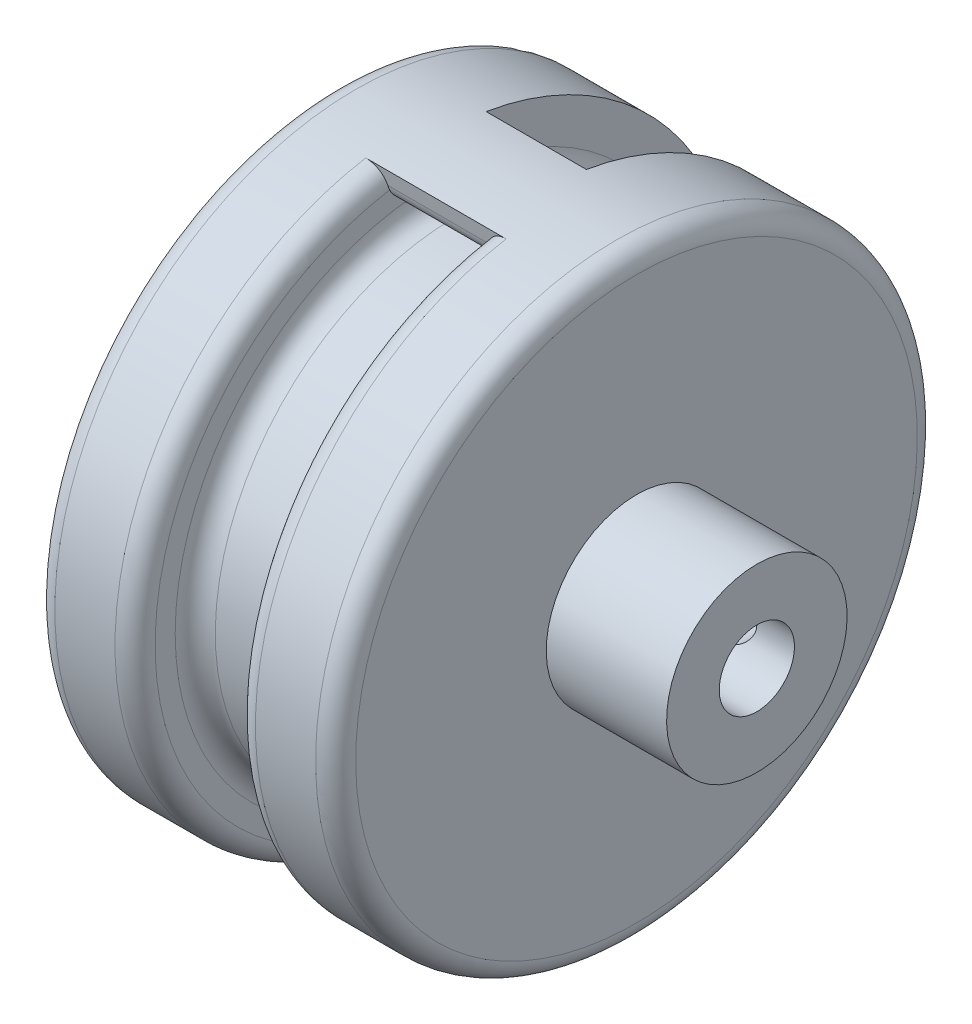
ISO-10303-21;
HEADER;
FILE_DESCRIPTION(('STEP AP214'),'2;1');
FILE_NAME('part.step','',(''),(''),'','','');
FILE_SCHEMA(('AUTOMOTIVE_DESIGN { 1 0 10303 214 1 1 1 1 }'));
ENDSEC;
DATA;
#1=APPLICATION_CONTEXT('core data for automotive mechanical design processes');
#2=APPLICATION_PROTOCOL_DEFINITION('international standard','automotive_design',2000,#1);
#3=PRODUCT_CONTEXT('',#1,'mechanical');
#4=PRODUCT('Part','Part','',(#3));
#5=PRODUCT_RELATED_PRODUCT_CATEGORY('part','',(#4));
#6=PRODUCT_DEFINITION_FORMATION('','',#4);
#7=PRODUCT_DEFINITION_CONTEXT('part definition',#1,'design');
#8=PRODUCT_DEFINITION('design','',#6,#7);
#9=PRODUCT_DEFINITION_SHAPE('','',#8);
#10=(LENGTH_UNIT() NAMED_UNIT(*) SI_UNIT(.MILLI.,.METRE.));
#11=(NAMED_UNIT(*) PLANE_ANGLE_UNIT() SI_UNIT($,.RADIAN.));
#12=(NAMED_UNIT(*) SI_UNIT($,.STERADIAN.) SOLID_ANGLE_UNIT());
#13=UNCERTAINTY_MEASURE_WITH_UNIT(LENGTH_MEASURE(1.E-05),#10,'distance_accuracy_value','');
#14=(GEOMETRIC_REPRESENTATION_CONTEXT(3) GLOBAL_UNCERTAINTY_ASSIGNED_CONTEXT((#13)) GLOBAL_UNIT_ASSIGNED_CONTEXT((#10,
#11,#12)) REPRESENTATION_CONTEXT('',''));
#15=CARTESIAN_POINT('',(0.,0.,0.));
#16=DIRECTION('',(0.,0.,1.));
#17=DIRECTION('',(1.,0.,0.));
#18=AXIS2_PLACEMENT_3D('',#15,#16,#17);
#19=CARTESIAN_POINT('',(-5.,30.,0.));
#20=DIRECTION('',(1.,0.,0.));
#21=DIRECTION('',(0.,1.,0.));
#22=AXIS2_PLACEMENT_3D('',#19,#20,#21);
#23=PLANE('',#22);
#24=CARTESIAN_POINT('',(-5.,0.,0.));
#25=DIRECTION('',(1.,0.,0.));
#26=DIRECTION('',(0.,1.,0.));
#27=AXIS2_PLACEMENT_3D('',#24,#25,#26);
#28=CIRCLE('',#27,26.);
#29=CARTESIAN_POINT('',(-5.,26.,0.));
#30=VERTEX_POINT('',#29);
#31=EDGE_CURVE('E639',#30,#30,#28,.F.);
#32=ORIENTED_EDGE('',*,*,#31,.T.);
#33=EDGE_LOOP('',(#32));
#34=FACE_BOUND('',#33,.T.);
#35=CARTESIAN_POINT('',(-5.,-3.50000000000014,0.));
#36=DIRECTION('',(1.,0.,0.));
#37=DIRECTION('',(0.,1.,0.));
#38=AXIS2_PLACEMENT_3D('',#35,#36,#37);
#39=CIRCLE('',#38,30.);
#40=CARTESIAN_POINT('',(-5.,26.3874965221958,2.59567941697875));
#41=VERTEX_POINT('',#40);
#42=CARTESIAN_POINT('',(-5.,26.3874965221958,-2.59567941697875));
#43=VERTEX_POINT('',#42);
#44=EDGE_CURVE('E200',#41,#43,#39,.F.);
#45=ORIENTED_EDGE('',*,*,#44,.F.);
#46=CARTESIAN_POINT('',(-5.,28.3799962903422,2.768724711444));
#47=DIRECTION('',(1.,0.,0.));
#48=DIRECTION('',(0.,1.,0.));
#49=AXIS2_PLACEMENT_3D('',#46,#47,#48);
#50=CIRCLE('',#49,2.);
#51=CARTESIAN_POINT('',(-5.,27.6166670042081,4.61732645355344));
#52=VERTEX_POINT('',#51);
#53=EDGE_CURVE('E54',#41,#52,#50,.F.);
#54=ORIENTED_EDGE('',*,*,#53,.T.);
#55=CARTESIAN_POINT('',(-5.,0.,0.));
#56=DIRECTION('',(1.,0.,0.));
#57=DIRECTION('',(0.,1.,0.));
#58=AXIS2_PLACEMENT_3D('',#55,#56,#57);
#59=CIRCLE('',#58,28.);
#60=CARTESIAN_POINT('',(-5.,-27.6166670042081,4.61732645355344));
#61=VERTEX_POINT('',#60);
#62=EDGE_CURVE('E60',#52,#61,#59,.T.);
#63=ORIENTED_EDGE('',*,*,#62,.T.);
#64=CARTESIAN_POINT('',(-5.,-28.3799962903422,2.768724711444));
#65=DIRECTION('',(1.,0.,0.));
#66=DIRECTION('',(0.,1.,0.));
#67=AXIS2_PLACEMENT_3D('',#64,#65,#66);
#68=CIRCLE('',#67,2.);
#69=CARTESIAN_POINT('',(-5.,-26.3874965221958,2.59567941697875));
#70=VERTEX_POINT('',#69);
#71=EDGE_CURVE('E347',#61,#70,#68,.F.);
#72=ORIENTED_EDGE('',*,*,#71,.T.);
#73=CARTESIAN_POINT('',(-5.,3.50000000000014,0.));
#74=DIRECTION('',(1.,0.,0.));
#75=DIRECTION('',(0.,1.,0.));
#76=AXIS2_PLACEMENT_3D('',#73,#74,#75);
#77=CIRCLE('',#76,30.);
#78=CARTESIAN_POINT('',(-5.,-26.3874965221958,-2.59567941697875));
#79=VERTEX_POINT('',#78);
#80=EDGE_CURVE('E385',#70,#79,#77,.T.);
#81=ORIENTED_EDGE('',*,*,#80,.T.);
#82=CARTESIAN_POINT('',(-5.,-28.3799962903422,-2.768724711444));
#83=DIRECTION('',(1.,0.,0.));
#84=DIRECTION('',(0.,1.,0.));
#85=AXIS2_PLACEMENT_3D('',#82,#83,#84);
#86=CIRCLE('',#85,2.);
#87=CARTESIAN_POINT('',(-5.,-28.0466629570088,-4.74075130581054));
#88=VERTEX_POINT('',#87);
#89=EDGE_CURVE('E337',#79,#88,#86,.F.);
#90=ORIENTED_EDGE('',*,*,#89,.T.);
#91=DIRECTION('',(0.,-0.986013297183269,-0.166666666666667));
#92=VECTOR('',#91,1.);
#93=CARTESIAN_POINT('',(-5.,29.1666666666667,4.93006648591635));
#94=LINE('',#93,#92);
#95=CARTESIAN_POINT('',(-5.,-29.5803989154981,-5.));
#96=VERTEX_POINT('',#95);
#97=EDGE_CURVE('E157',#88,#96,#94,.T.);
#98=ORIENTED_EDGE('',*,*,#97,.T.);
#99=CARTESIAN_POINT('',(-5.,0.,0.));
#100=DIRECTION('',(1.,0.,0.));
#101=DIRECTION('',(0.,1.,0.));
#102=AXIS2_PLACEMENT_3D('',#99,#100,#101);
#103=CIRCLE('',#102,30.);
#104=CARTESIAN_POINT('',(-5.,29.5803989154981,-5.));
#105=VERTEX_POINT('',#104);
#106=EDGE_CURVE('E166',#96,#105,#103,.T.);
#107=ORIENTED_EDGE('',*,*,#106,.T.);
#108=DIRECTION('',(0.,0.986013297183269,-0.166666666666667));
#109=VECTOR('',#108,1.);
#110=CARTESIAN_POINT('',(-5.,29.1666666666667,-4.93006648591635));
#111=LINE('',#110,#109);
#112=CARTESIAN_POINT('',(-5.,28.0466629570088,-4.74075130581054));
#113=VERTEX_POINT('',#112);
#114=EDGE_CURVE('E401',#113,#105,#111,.T.);
#115=ORIENTED_EDGE('',*,*,#114,.F.);
#116=CARTESIAN_POINT('',(-5.,28.3799962903422,-2.768724711444));
#117=DIRECTION('',(1.,0.,0.));
#118=DIRECTION('',(0.,1.,0.));
#119=AXIS2_PLACEMENT_3D('',#116,#117,#118);
#120=CIRCLE('',#119,2.);
#121=EDGE_CURVE('E278',#113,#43,#120,.F.);
#122=ORIENTED_EDGE('',*,*,#121,.T.);
#123=EDGE_LOOP('',(#45,#54,#63,#72,#81,#90,#98,#107,#115,#122));
#124=FACE_BOUND('',#123,.T.);
#125=ADVANCED_FACE('F39',(#34,#124),#23,.T.);
#126=CARTESIAN_POINT('',(5.,24.,0.));
#127=DIRECTION('',(-1.,0.,0.));
#128=DIRECTION('',(0.,-1.,0.));
#129=AXIS2_PLACEMENT_3D('',#126,#127,#128);
#130=PLANE('',#129);
#131=CARTESIAN_POINT('',(5.,0.,0.));
#132=DIRECTION('',(-1.,0.,0.));
#133=DIRECTION('',(0.,-1.,0.));
#134=AXIS2_PLACEMENT_3D('',#131,#132,#133);
#135=CIRCLE('',#134,26.);
#136=CARTESIAN_POINT('',(5.,-26.,0.));
#137=VERTEX_POINT('',#136);
#138=EDGE_CURVE('E625',#137,#137,#135,.F.);
#139=ORIENTED_EDGE('',*,*,#138,.T.);
#140=EDGE_LOOP('',(#139));
#141=FACE_BOUND('',#140,.T.);
#142=CARTESIAN_POINT('',(5.,3.50000000000014,0.));
#143=DIRECTION('',(-1.,0.,0.));
#144=DIRECTION('',(0.,-1.,0.));
#145=AXIS2_PLACEMENT_3D('',#142,#143,#144);
#146=CIRCLE('',#145,30.);
#147=CARTESIAN_POINT('',(5.,-26.3874965221958,-2.59567941697875));
#148=VERTEX_POINT('',#147);
#149=CARTESIAN_POINT('',(5.,-26.3874965221958,2.59567941697875));
#150=VERTEX_POINT('',#149);
#151=EDGE_CURVE('E387',#148,#150,#146,.T.);
#152=ORIENTED_EDGE('',*,*,#151,.T.);
#153=CARTESIAN_POINT('',(5.,-28.3799962903422,2.768724711444));
#154=DIRECTION('',(-1.,0.,0.));
#155=DIRECTION('',(0.,-1.,0.));
#156=AXIS2_PLACEMENT_3D('',#153,#154,#155);
#157=CIRCLE('',#156,2.);
#158=CARTESIAN_POINT('',(5.,-27.6166670042081,4.61732645355344));
#159=VERTEX_POINT('',#158);
#160=EDGE_CURVE('E339',#150,#159,#157,.F.);
#161=ORIENTED_EDGE('',*,*,#160,.T.);
#162=CARTESIAN_POINT('',(5.,0.,0.));
#163=DIRECTION('',(-1.,0.,0.));
#164=DIRECTION('',(0.,-1.,0.));
#165=AXIS2_PLACEMENT_3D('',#162,#163,#164);
#166=CIRCLE('',#165,28.);
#167=CARTESIAN_POINT('',(5.,27.6166670042081,4.61732645355344));
#168=VERTEX_POINT('',#167);
#169=EDGE_CURVE('E68',#159,#168,#166,.T.);
#170=ORIENTED_EDGE('',*,*,#169,.T.);
#171=CARTESIAN_POINT('',(5.,28.3799962903422,2.768724711444));
#172=DIRECTION('',(-1.,0.,0.));
#173=DIRECTION('',(0.,-1.,0.));
#174=AXIS2_PLACEMENT_3D('',#171,#172,#173);
#175=CIRCLE('',#174,2.);
#176=CARTESIAN_POINT('',(5.,26.3874965221958,2.59567941697875));
#177=VERTEX_POINT('',#176);
#178=EDGE_CURVE('E277',#168,#177,#175,.F.);
#179=ORIENTED_EDGE('',*,*,#178,.T.);
#180=CARTESIAN_POINT('',(5.,-3.50000000000014,0.));
#181=DIRECTION('',(-1.,0.,0.));
#182=DIRECTION('',(0.,-1.,0.));
#183=AXIS2_PLACEMENT_3D('',#180,#181,#182);
#184=CIRCLE('',#183,30.);
#185=CARTESIAN_POINT('',(5.,26.3874965221958,-2.59567941697875));
#186=VERTEX_POINT('',#185);
#187=EDGE_CURVE('E403',#186,#177,#184,.F.);
#188=ORIENTED_EDGE('',*,*,#187,.F.);
#189=CARTESIAN_POINT('',(5.,28.3799962903422,-2.768724711444));
#190=DIRECTION('',(-1.,0.,0.));
#191=DIRECTION('',(0.,-1.,0.));
#192=AXIS2_PLACEMENT_3D('',#189,#190,#191);
#193=CIRCLE('',#192,2.);
#194=CARTESIAN_POINT('',(5.,28.0466629570088,-4.74075130581054));
#195=VERTEX_POINT('',#194);
#196=EDGE_CURVE('E352',#186,#195,#193,.F.);
#197=ORIENTED_EDGE('',*,*,#196,.T.);
#198=DIRECTION('',(0.,-0.986013297183269,0.166666666666667));
#199=VECTOR('',#198,1.);
#200=CARTESIAN_POINT('',(5.,23.3333333333333,-3.94405318873308));
#201=LINE('',#200,#199);
#202=CARTESIAN_POINT('',(5.,29.5803989154981,-5.));
#203=VERTEX_POINT('',#202);
#204=EDGE_CURVE('E173',#203,#195,#201,.T.);
#205=ORIENTED_EDGE('',*,*,#204,.F.);
#206=CARTESIAN_POINT('',(5.,0.,0.));
#207=DIRECTION('',(1.,0.,0.));
#208=DIRECTION('',(0.,1.,0.));
#209=AXIS2_PLACEMENT_3D('',#206,#207,#208);
#210=CIRCLE('',#209,30.);
#211=CARTESIAN_POINT('',(4.99999999999999,-29.5803989154981,-5.));
#212=VERTEX_POINT('',#211);
#213=EDGE_CURVE('E163',#212,#203,#210,.T.);
#214=ORIENTED_EDGE('',*,*,#213,.F.);
#215=DIRECTION('',(0.,0.986013297183269,0.166666666666667));
#216=VECTOR('',#215,1.);
#217=CARTESIAN_POINT('',(5.,23.3333333333333,3.94405318873308));
#218=LINE('',#217,#216);
#219=CARTESIAN_POINT('',(5.,-28.0466629570088,-4.74075130581054));
#220=VERTEX_POINT('',#219);
#221=EDGE_CURVE('E147',#212,#220,#218,.T.);
#222=ORIENTED_EDGE('',*,*,#221,.T.);
#223=CARTESIAN_POINT('',(5.,-28.3799962903422,-2.768724711444));
#224=DIRECTION('',(-1.,0.,0.));
#225=DIRECTION('',(0.,-1.,0.));
#226=AXIS2_PLACEMENT_3D('',#223,#224,#225);
#227=CIRCLE('',#226,2.);
#228=EDGE_CURVE('E334',#220,#148,#227,.F.);
#229=ORIENTED_EDGE('',*,*,#228,.T.);
#230=EDGE_LOOP('',(#152,#161,#170,#179,#188,#197,#205,#214,#222,#229));
#231=FACE_BOUND('',#230,.T.);
#232=ADVANCED_FACE('F171',(#141,#231),#130,.T.);
#233=CARTESIAN_POINT('',(-15.,0.,0.));
#234=DIRECTION('',(-1.,0.,0.));
#235=DIRECTION('',(0.,-1.,0.));
#236=AXIS2_PLACEMENT_3D('',#233,#234,#235);
#237=PLANE('',#236);
#238=CARTESIAN_POINT('',(-15.,0.,0.));
#239=DIRECTION('',(-1.,0.,0.));
#240=DIRECTION('',(0.,-1.,0.));
#241=AXIS2_PLACEMENT_3D('',#238,#239,#240);
#242=CIRCLE('',#241,28.);
#243=CARTESIAN_POINT('',(-15.,-28.,0.));
#244=VERTEX_POINT('',#243);
#245=EDGE_CURVE('E635',#244,#244,#242,.T.);
#246=ORIENTED_EDGE('',*,*,#245,.T.);
#247=EDGE_LOOP('',(#246));
#248=FACE_BOUND('',#247,.T.);
#249=CARTESIAN_POINT('',(-15.,0.,0.));
#250=DIRECTION('',(1.,0.,0.));
#251=DIRECTION('',(0.,1.,0.));
#252=AXIS2_PLACEMENT_3D('',#249,#250,#251);
#253=CIRCLE('',#252,3.75);
#254=CARTESIAN_POINT('',(-15.,3.75,0.));
#255=VERTEX_POINT('',#254);
#256=EDGE_CURVE('E189',#255,#255,#253,.T.);
#257=ORIENTED_EDGE('',*,*,#256,.T.);
#258=EDGE_LOOP('',(#257));
#259=FACE_BOUND('',#258,.T.);
#260=ADVANCED_FACE('F240',(#248,#259),#237,.T.);
#261=CARTESIAN_POINT('',(15.,0.,0.));
#262=DIRECTION('',(1.,0.,0.));
#263=DIRECTION('',(0.,1.,0.));
#264=AXIS2_PLACEMENT_3D('',#261,#262,#263);
#265=CYLINDRICAL_SURFACE('',#264,24.);
#266=CARTESIAN_POINT('',(3.,0.,0.));
#267=DIRECTION('',(-1.,0.,0.));
#268=DIRECTION('',(0.,-1.,0.));
#269=AXIS2_PLACEMENT_3D('',#266,#267,#268);
#270=CIRCLE('',#269,24.);
#271=CARTESIAN_POINT('',(3.,-24.,0.));
#272=VERTEX_POINT('',#271);
#273=EDGE_CURVE('E649',#272,#272,#270,.T.);
#274=ORIENTED_EDGE('',*,*,#273,.T.);
#275=EDGE_LOOP('',(#274));
#276=FACE_BOUND('',#275,.T.);
#277=CARTESIAN_POINT('',(-3.,0.,0.));
#278=DIRECTION('',(1.,0.,0.));
#279=DIRECTION('',(0.,1.,0.));
#280=AXIS2_PLACEMENT_3D('',#277,#278,#279);
#281=CIRCLE('',#280,24.);
#282=CARTESIAN_POINT('',(-3.,24.,0.));
#283=VERTEX_POINT('',#282);
#284=EDGE_CURVE('E645',#283,#283,#281,.T.);
#285=ORIENTED_EDGE('',*,*,#284,.T.);
#286=EDGE_LOOP('',(#285));
#287=FACE_BOUND('',#286,.T.);
#288=ADVANCED_FACE('F236',(#276,#287),#265,.T.);
#289=CARTESIAN_POINT('',(15.,0.,0.));
#290=DIRECTION('',(1.,0.,0.));
#291=DIRECTION('',(0.,1.,0.));
#292=AXIS2_PLACEMENT_3D('',#289,#290,#291);
#293=CYLINDRICAL_SURFACE('',#292,30.);
#294=CARTESIAN_POINT('',(13.,0.,0.));
#295=DIRECTION('',(1.,0.,0.));
#296=DIRECTION('',(0.,1.,0.));
#297=AXIS2_PLACEMENT_3D('',#294,#295,#296);
#298=CIRCLE('',#297,30.);
#299=CARTESIAN_POINT('',(13.,30.,0.));
#300=VERTEX_POINT('',#299);
#301=EDGE_CURVE('E614',#300,#300,#298,.F.);
#302=ORIENTED_EDGE('',*,*,#301,.T.);
#303=EDGE_LOOP('',(#302));
#304=FACE_BOUND('',#303,.T.);
#305=CARTESIAN_POINT('',(-13.,0.,0.));
#306=DIRECTION('',(-1.,0.,0.));
#307=DIRECTION('',(0.,-1.,0.));
#308=AXIS2_PLACEMENT_3D('',#305,#306,#307);
#309=CIRCLE('',#308,30.);
#310=CARTESIAN_POINT('',(-13.,-30.,0.));
#311=VERTEX_POINT('',#310);
#312=EDGE_CURVE('E609',#311,#311,#309,.F.);
#313=ORIENTED_EDGE('',*,*,#312,.T.);
#314=EDGE_LOOP('',(#313));
#315=FACE_BOUND('',#314,.T.);
#316=CARTESIAN_POINT('',(7.,0.,0.));
#317=DIRECTION('',(-1.,0.,0.));
#318=DIRECTION('',(0.,-1.,0.));
#319=AXIS2_PLACEMENT_3D('',#316,#317,#318);
#320=CIRCLE('',#319,30.);
#321=CARTESIAN_POINT('',(7.,29.5803989154981,5.));
#322=VERTEX_POINT('',#321);
#323=CARTESIAN_POINT('',(7.,-29.5803989154981,5.));
#324=VERTEX_POINT('',#323);
#325=EDGE_CURVE('E619',#322,#324,#320,.F.);
#326=ORIENTED_EDGE('',*,*,#325,.T.);
#327=DIRECTION('',(1.,0.,0.));
#328=VECTOR('',#327,1.);
#329=CARTESIAN_POINT('',(-25.7076311464045,-29.5803989154981,5.));
#330=LINE('',#329,#328);
#331=CARTESIAN_POINT('',(-7.,-29.5803989154981,5.));
#332=VERTEX_POINT('',#331);
#333=EDGE_CURVE('E158',#332,#324,#330,.T.);
#334=ORIENTED_EDGE('',*,*,#333,.F.);
#335=CARTESIAN_POINT('',(-7.,0.,0.));
#336=DIRECTION('',(1.,0.,0.));
#337=DIRECTION('',(0.,1.,0.));
#338=AXIS2_PLACEMENT_3D('',#335,#336,#337);
#339=CIRCLE('',#338,30.);
#340=CARTESIAN_POINT('',(-7.00000000000001,29.5803989154981,5.));
#341=VERTEX_POINT('',#340);
#342=EDGE_CURVE('E201',#332,#341,#339,.F.);
#343=ORIENTED_EDGE('',*,*,#342,.T.);
#344=DIRECTION('',(1.,0.,0.));
#345=VECTOR('',#344,1.);
#346=CARTESIAN_POINT('',(-25.7076311464045,29.5803989154981,5.));
#347=LINE('',#346,#345);
#348=EDGE_CURVE('E300',#341,#322,#347,.T.);
#349=ORIENTED_EDGE('',*,*,#348,.T.);
#350=EDGE_LOOP('',(#326,#334,#343,#349));
#351=FACE_BOUND('',#350,.T.);
#352=ORIENTED_EDGE('',*,*,#106,.F.);
#353=DIRECTION('',(1.,0.,0.));
#354=VECTOR('',#353,1.);
#355=CARTESIAN_POINT('',(-25.7076311464045,-29.5803989154981,-5.));
#356=LINE('',#355,#354);
#357=EDGE_CURVE('E151',#96,#212,#356,.T.);
#358=ORIENTED_EDGE('',*,*,#357,.T.);
#359=ORIENTED_EDGE('',*,*,#213,.T.);
#360=DIRECTION('',(1.,0.,0.));
#361=VECTOR('',#360,1.);
#362=CARTESIAN_POINT('',(-25.7076311464045,29.5803989154981,-5.));
#363=LINE('',#362,#361);
#364=EDGE_CURVE('E394',#105,#203,#363,.T.);
#365=ORIENTED_EDGE('',*,*,#364,.F.);
#366=EDGE_LOOP('',(#352,#358,#359,#365));
#367=FACE_BOUND('',#366,.T.);
#368=ADVANCED_FACE('F161',(#304,#315,#351,#367),#293,.T.);
#369=CARTESIAN_POINT('',(15.,30.,0.));
#370=DIRECTION('',(1.,0.,0.));
#371=DIRECTION('',(0.,1.,0.));
#372=AXIS2_PLACEMENT_3D('',#369,#370,#371);
#373=PLANE('',#372);
#374=CARTESIAN_POINT('',(15.,0.,0.));
#375=DIRECTION('',(1.,0.,0.));
#376=DIRECTION('',(0.,1.,0.));
#377=AXIS2_PLACEMENT_3D('',#374,#375,#376);
#378=CIRCLE('',#377,28.);
#379=CARTESIAN_POINT('',(15.,28.,0.));
#380=VERTEX_POINT('',#379);
#381=EDGE_CURVE('E631',#380,#380,#378,.T.);
#382=ORIENTED_EDGE('',*,*,#381,.T.);
#383=EDGE_LOOP('',(#382));
#384=FACE_BOUND('',#383,.T.);
#385=CARTESIAN_POINT('',(15.,0.,0.));
#386=DIRECTION('',(1.,0.,0.));
#387=DIRECTION('',(0.,1.,0.));
#388=AXIS2_PLACEMENT_3D('',#385,#386,#387);
#389=CIRCLE('',#388,9.);
#390=CARTESIAN_POINT('',(15.,9.,0.));
#391=VERTEX_POINT('',#390);
#392=EDGE_CURVE('E179',#391,#391,#389,.T.);
#393=ORIENTED_EDGE('',*,*,#392,.F.);
#394=EDGE_LOOP('',(#393));
#395=FACE_BOUND('',#394,.T.);
#396=ADVANCED_FACE('F229',(#384,#395),#373,.T.);
#397=CARTESIAN_POINT('',(27.,0.,0.));
#398=DIRECTION('',(-1.,0.,0.));
#399=DIRECTION('',(0.,-1.,0.));
#400=AXIS2_PLACEMENT_3D('',#397,#398,#399);
#401=CYLINDRICAL_SURFACE('',#400,9.);
#402=CARTESIAN_POINT('',(23.25,0.,-9.));
#403=CARTESIAN_POINT('',(23.2499965113928,0.124314133004596,-8.99999789802018));
#404=CARTESIAN_POINT('',(23.2396626738393,0.248667236746143,-8.99739867197739));
#405=CARTESIAN_POINT('',(23.1986622730395,0.493809485655798,-8.98728170744842));
#406=CARTESIAN_POINT('',(23.1679841856932,0.614596570306108,-8.97976118129964));
#407=CARTESIAN_POINT('',(23.0873411198069,0.849031308273863,-8.96063439498048));
#408=CARTESIAN_POINT('',(23.0373993019271,0.962687345145001,-8.94903304263087));
#409=CARTESIAN_POINT('',(22.9197279149327,1.18000819785664,-8.92298015711432));
#410=CARTESIAN_POINT('',(22.8519977458215,1.28367267652314,-8.90852852781235));
#411=CARTESIAN_POINT('',(22.6991988155187,1.48020289095137,-8.8780112038754));
#412=CARTESIAN_POINT('',(22.6138326375614,1.57283353509158,-8.86192060722189));
#413=CARTESIAN_POINT('',(22.4288216926364,1.74262339080498,-8.83010430176904));
#414=CARTESIAN_POINT('',(22.3291753155796,1.81978085542379,-8.81437863434801));
#415=CARTESIAN_POINT('',(22.1166071598945,1.95753981419846,-8.78482163547253));
#416=CARTESIAN_POINT('',(22.0035101537869,2.01787832388771,-8.77102191697217));
#417=CARTESIAN_POINT('',(21.76837738251,2.11859536282611,-8.74724242227025));
#418=CARTESIAN_POINT('',(21.646343050002,2.15897708316021,-8.73726203541628));
#419=CARTESIAN_POINT('',(21.3993847526975,2.21783225520714,-8.72250715044484));
#420=CARTESIAN_POINT('',(21.274567655943,2.23672840249808,-8.71763236495517));
#421=CARTESIAN_POINT('',(21.023447146501,2.25339266259961,-8.71334043689387));
#422=CARTESIAN_POINT('',(20.8971439789618,2.25116421272716,-8.71392240641893));
#423=CARTESIAN_POINT('',(20.649876288382,2.22597978695956,-8.72038808275225));
#424=CARTESIAN_POINT('',(20.528856567802,2.20352751028595,-8.72614294510941));
#425=CARTESIAN_POINT('',(20.2923584236334,2.13933628035449,-8.74210064506603));
#426=CARTESIAN_POINT('',(20.1768803954566,2.09759595310409,-8.75230379953858));
#427=CARTESIAN_POINT('',(19.9533929756218,1.99558421690578,-8.77612670858488));
#428=CARTESIAN_POINT('',(19.8454707423157,1.93513000084938,-8.78977991204724));
#429=CARTESIAN_POINT('',(19.6411219353648,1.79753441402242,-8.81894566268987));
#430=CARTESIAN_POINT('',(19.5446973778991,1.72039012321325,-8.83445853501942));
#431=CARTESIAN_POINT('',(19.3631945764584,1.54899513702183,-8.86613820809837));
#432=CARTESIAN_POINT('',(19.278518264908,1.45431938724879,-8.88231104217001));
#433=CARTESIAN_POINT('',(19.1261681363041,1.25191787625555,-8.91308948368134));
#434=CARTESIAN_POINT('',(19.0584948386047,1.14419171656191,-8.92769504324111));
#435=CARTESIAN_POINT('',(18.9419241206634,0.918173833022087,-8.95376598141286));
#436=CARTESIAN_POINT('',(18.8930919896184,0.799847089812935,-8.96522040191591));
#437=CARTESIAN_POINT('',(18.8161240414356,0.556314012214324,-8.98361875487124));
#438=CARTESIAN_POINT('',(18.7879842653728,0.431108998725727,-8.9905635500892));
#439=CARTESIAN_POINT('',(18.7538136516617,0.18080995558504,-8.99903248907063));
#440=CARTESIAN_POINT('',(18.7472354608871,0.0557950799823149,-9.00069080262418));
#441=CARTESIAN_POINT('',(18.7548735030832,-0.193549312202261,-8.99878207221676));
#442=CARTESIAN_POINT('',(18.7690878641987,-0.317878889466892,-8.9952154986277));
#443=CARTESIAN_POINT('',(18.8174563625871,-0.560421403164737,-8.98334371691035));
#444=CARTESIAN_POINT('',(18.8513118952155,-0.678697678453131,-8.97510951278717));
#445=CARTESIAN_POINT('',(18.9376606260427,-0.907885938678766,-8.95483059951201));
#446=CARTESIAN_POINT('',(18.9901557064698,-1.01879717854895,-8.94278550554838));
#447=CARTESIAN_POINT('',(19.1133541933121,-1.23228470164477,-8.91589961889465));
#448=CARTESIAN_POINT('',(19.1843641685951,-1.33467816275375,-8.90101301050398));
#449=CARTESIAN_POINT('',(19.3421848631955,-1.52628992046487,-8.87016763781129));
#450=CARTESIAN_POINT('',(19.4289983094254,-1.61550593845951,-8.85420868877557));
#451=CARTESIAN_POINT('',(19.6185029412667,-1.78048585210909,-8.82253435441157));
#452=CARTESIAN_POINT('',(19.7215315545036,-1.85586580143305,-8.80683456280921));
#453=CARTESIAN_POINT('',(19.9390989516986,-1.98826613851904,-8.77789317565858));
#454=CARTESIAN_POINT('',(20.0536372244396,-2.0452873412369,-8.76465147100539));
#455=CARTESIAN_POINT('',(20.2903585836196,-2.13892713091394,-8.74227142101998));
#456=CARTESIAN_POINT('',(20.412491442516,-2.1756665949811,-8.73310882937859));
#457=CARTESIAN_POINT('',(20.6614644568337,-2.22801848993067,-8.71990116135275));
#458=CARTESIAN_POINT('',(20.7883035765487,-2.24363554121799,-8.71585496579904));
#459=CARTESIAN_POINT('',(21.0391815357828,-2.25305788550099,-8.71342351805935));
#460=CARTESIAN_POINT('',(21.1631961526871,-2.24747684667018,-8.71487899092395));
#461=CARTESIAN_POINT('',(21.408455833002,-2.2160659174693,-8.72291863511764));
#462=CARTESIAN_POINT('',(21.5297009520205,-2.19023643403015,-8.72950270337785));
#463=CARTESIAN_POINT('',(21.7653126885981,-2.11939697916419,-8.74696891024084));
#464=CARTESIAN_POINT('',(21.8797159578603,-2.07450210702056,-8.75782522854464));
#465=CARTESIAN_POINT('',(22.0994480740705,-1.96689737040761,-8.78261633587243));
#466=CARTESIAN_POINT('',(22.2047756597804,-1.90418503505128,-8.79655155181159));
#467=CARTESIAN_POINT('',(22.406331943503,-1.7608016229557,-8.82638451395268));
#468=CARTESIAN_POINT('',(22.5022516101359,-1.67970474436838,-8.84232397247635));
#469=CARTESIAN_POINT('',(22.6793205671931,-1.5026840567846,-8.87412040869429));
#470=CARTESIAN_POINT('',(22.7604663451695,-1.40675673189172,-8.88997736590589));
#471=CARTESIAN_POINT('',(22.9071169628469,-1.20070138005388,-8.92016483471494));
#472=CARTESIAN_POINT('',(22.9723119205074,-1.09034763347458,-8.93446250048802));
#473=CARTESIAN_POINT('',(23.0831211944108,-0.859899089265716,-8.95957387462677));
#474=CARTESIAN_POINT('',(23.1287495409728,-0.73981134515511,-8.97039007799672));
#475=CARTESIAN_POINT('',(23.1923577454945,-0.516615379865209,-8.98572089348312));
#476=CARTESIAN_POINT('',(23.2139268645801,-0.414570256362105,-8.99103877579036));
#477=CARTESIAN_POINT('',(23.2427489154329,-0.208359107304427,-8.99817907847922));
#478=CARTESIAN_POINT('',(23.250002923958,-0.104193241863926,-9.00000176176341));
#479=CARTESIAN_POINT('',(23.25,0.,-9.));
#480=B_SPLINE_CURVE_WITH_KNOTS('',3,(#402,#403,#404,#405,#406,#407,#408,#409,#410,#411,#412,
#413,#414,#415,#416,#417,#418,#419,#420,#421,#422,#423,#424,#425,#426,#427,#428,#429,#430,#431,
#432,#433,#434,#435,#436,#437,#438,#439,#440,#441,#442,#443,#444,#445,#446,#447,#448,#449,#450,
#451,#452,#453,#454,#455,#456,#457,#458,#459,#460,#461,#462,#463,#464,#465,#466,#467,#468,#469,
#470,#471,#472,#473,#474,#475,#476,#477,#478,#479),.UNSPECIFIED.,.T.,.F.,(4,2,2,2,2,2,2,2,2,2,2,
2,2,2,2,2,2,2,2,2,2,2,2,2,2,2,2,2,2,2,2,2,2,2,2,2,2,2,4),(0.,0.372560568707834,
0.745332356645848,1.11765735342916,1.48999491025399,1.86921653155709,2.24848094370093,
2.6333797131871,3.01821691754052,3.39534442651604,3.77241057174026,4.14033745515507,
4.50829055204038,4.87995791815799,5.25169036259225,5.6340225145851,6.01636634342351,
6.40002343518651,6.78360710537945,7.15737463428895,7.53110851674094,7.89930411776036,
8.26753690988416,8.64230381353008,9.01713544517009,9.40116763811694,9.78518278129242,
10.1668838192603,10.5485013488359,10.919156706029,11.2898046143903,11.6582460084415,
12.0267385221033,12.4048436461985,12.7830385466061,13.1680827825436,13.55285045737,
13.865133644182,14.1773933406954),.UNSPECIFIED.);
#481=CARTESIAN_POINT('',(23.25,0.,-9.));
#482=VERTEX_POINT('',#481);
#483=EDGE_CURVE('E199',#482,#482,#480,.T.);
#484=ORIENTED_EDGE('',*,*,#483,.T.);
#485=EDGE_LOOP('',(#484));
#486=FACE_BOUND('',#485,.T.);
#487=CARTESIAN_POINT('',(27.,0.,0.));
#488=DIRECTION('',(1.,0.,0.));
#489=DIRECTION('',(0.,1.,0.));
#490=AXIS2_PLACEMENT_3D('',#487,#488,#489);
#491=CIRCLE('',#490,9.);
#492=CARTESIAN_POINT('',(27.,9.,0.));
#493=VERTEX_POINT('',#492);
#494=EDGE_CURVE('E175',#493,#493,#491,.T.);
#495=ORIENTED_EDGE('',*,*,#494,.F.);
#496=EDGE_LOOP('',(#495));
#497=FACE_BOUND('',#496,.T.);
#498=ORIENTED_EDGE('',*,*,#392,.T.);
#499=EDGE_LOOP('',(#498));
#500=FACE_BOUND('',#499,.T.);
#501=ADVANCED_FACE('F224',(#486,#497,#500),#401,.T.);
#502=CARTESIAN_POINT('',(27.,0.,0.));
#503=DIRECTION('',(1.,0.,0.));
#504=DIRECTION('',(0.,1.,0.));
#505=AXIS2_PLACEMENT_3D('',#502,#503,#504);
#506=PLANE('',#505);
#507=CARTESIAN_POINT('',(27.,0.,0.));
#508=DIRECTION('',(1.,0.,0.));
#509=DIRECTION('',(0.,1.,0.));
#510=AXIS2_PLACEMENT_3D('',#507,#508,#509);
#511=CIRCLE('',#510,3.75);
#512=CARTESIAN_POINT('',(27.,3.75,0.));
#513=VERTEX_POINT('',#512);
#514=EDGE_CURVE('E182',#513,#513,#511,.T.);
#515=ORIENTED_EDGE('',*,*,#514,.F.);
#516=EDGE_LOOP('',(#515));
#517=FACE_BOUND('',#516,.T.);
#518=ORIENTED_EDGE('',*,*,#494,.T.);
#519=EDGE_LOOP('',(#518));
#520=FACE_BOUND('',#519,.T.);
#521=ADVANCED_FACE('F228',(#517,#520),#506,.T.);
#522=CARTESIAN_POINT('',(-15.,0.,0.));
#523=DIRECTION('',(1.,0.,0.));
#524=DIRECTION('',(0.,1.,0.));
#525=AXIS2_PLACEMENT_3D('',#522,#523,#524);
#526=CYLINDRICAL_SURFACE('',#525,3.75);
#527=CARTESIAN_POINT('',(23.25,0.,-3.75));
#528=CARTESIAN_POINT('',(23.2499927675934,-0.115092477860219,-3.74999345216861));
#529=CARTESIAN_POINT('',(23.2411066996759,-0.230372871492297,-3.74464331853056));
#530=CARTESIAN_POINT('',(23.2060138153875,-0.45746387527486,-3.7237488054421));
#531=CARTESIAN_POINT('',(23.1797642860055,-0.569265215258577,-3.70817928768741));
#532=CARTESIAN_POINT('',(23.1114203798503,-0.785627579124961,-3.66842330395107));
#533=CARTESIAN_POINT('',(23.0694045416986,-0.890221498678828,-3.64427958113509));
#534=CARTESIAN_POINT('',(22.9712095213399,-1.09054552097218,-3.58943053235072));
#535=CARTESIAN_POINT('',(22.9150338553817,-1.18627781622303,-3.55872683568027));
#536=CARTESIAN_POINT('',(22.7853377536561,-1.37444890547535,-3.49058040542931));
#537=CARTESIAN_POINT('',(22.7108194552825,-1.46607602661711,-3.45280188149806));
#538=CARTESIAN_POINT('',(22.5487991959502,-1.6363240596879,-3.37545659063808));
#539=CARTESIAN_POINT('',(22.4612805946964,-1.71492802521161,-3.33588757771074));
#540=CARTESIAN_POINT('',(22.2631147337189,-1.8666749503333,-3.25366600448153));
#541=CARTESIAN_POINT('',(22.1509473433859,-1.93796649538731,-3.21123026543346));
#542=CARTESIAN_POINT('',(21.9137301402773,-2.06042156676779,-3.13407452130292));
#543=CARTESIAN_POINT('',(21.7887016556618,-2.11161776009611,-3.09934203413732));
#544=CARTESIAN_POINT('',(21.560105323995,-2.1816090256612,-3.05031944489251));
#545=CARTESIAN_POINT('',(21.4586460020778,-2.20524295868844,-3.03311824705812));
#546=CARTESIAN_POINT('',(21.2522944262612,-2.23824258512107,-3.00885462443827));
#547=CARTESIAN_POINT('',(21.1474066068701,-2.24762601835627,-3.00177959465793));
#548=CARTESIAN_POINT('',(20.9369827586722,-2.25158263193638,-2.99881383695629));
#549=CARTESIAN_POINT('',(20.8314458623597,-2.24612675112527,-3.00294505519035));
#550=CARTESIAN_POINT('',(20.6230818368591,-2.22069090718342,-3.02179892165653));
#551=CARTESIAN_POINT('',(20.520256806229,-2.20070001930181,-3.03652953648349));
#552=CARTESIAN_POINT('',(20.3212046368077,-2.14760882822662,-3.07429780416376));
#553=CARTESIAN_POINT('',(20.2249094191132,-2.11468122999123,-3.09722567478803));
#554=CARTESIAN_POINT('',(20.0389575136079,-2.03692592656262,-3.14890577026245));
#555=CARTESIAN_POINT('',(19.9493032748641,-1.99209385889559,-3.17766012935198));
#556=CARTESIAN_POINT('',(19.7625238543158,-1.88276974776872,-3.24382990903477));
#557=CARTESIAN_POINT('',(19.6668328605676,-1.81621086596584,-3.28188065059488));
#558=CARTESIAN_POINT('',(19.4869852744995,-1.66936639176005,-3.35895899646572));
#559=CARTESIAN_POINT('',(19.4028398490352,-1.58906767650868,-3.39798750393224));
#560=CARTESIAN_POINT('',(19.2365805272674,-1.40371775157445,-3.47903257437475));
#561=CARTESIAN_POINT('',(19.156384040976,-1.29677652405744,-3.52070754402798));
#562=CARTESIAN_POINT('',(19.0153169292031,-1.06841407568851,-3.59658642650971));
#563=CARTESIAN_POINT('',(18.9544359693151,-0.947000645915351,-3.63079433138273));
#564=CARTESIAN_POINT('',(18.8581017258062,-0.700796377902314,-3.68595588099227));
#565=CARTESIAN_POINT('',(18.8212869664261,-0.576701436260375,-3.70760936159555));
#566=CARTESIAN_POINT('',(18.7694832038919,-0.322571842716966,-3.73828264220326));
#567=CARTESIAN_POINT('',(18.7544680233696,-0.192544508491988,-3.74731759429106));
#568=CARTESIAN_POINT('',(18.7477382284825,0.0505719215660933,-3.75135855561915));
#569=CARTESIAN_POINT('',(18.7531367173722,0.163563710128085,-3.74810282571428));
#570=CARTESIAN_POINT('',(18.7806387796079,0.386744102979074,-3.73168068130573));
#571=CARTESIAN_POINT('',(18.8027420142087,0.496932764064107,-3.71851446777057));
#572=CARTESIAN_POINT('',(18.8618151492187,0.708862398236459,-3.68392188663285));
#573=CARTESIAN_POINT('',(18.8984105236101,0.810743626392886,-3.6627041349383));
#574=CARTESIAN_POINT('',(18.985016064548,1.00689862363072,-3.6137082129427));
#575=CARTESIAN_POINT('',(19.0350288770202,1.10117088744524,-3.58592874879778));
#576=CARTESIAN_POINT('',(19.1528354688128,1.29000939423648,-3.52268244356029));
#577=CARTESIAN_POINT('',(19.2219357436166,1.38359122568794,-3.48671704109772));
#578=CARTESIAN_POINT('',(19.373087090234,1.55853904696252,-3.41211398362146));
#579=CARTESIAN_POINT('',(19.4551532322827,1.639890604096,-3.3734732487972));
#580=CARTESIAN_POINT('',(19.6423655850514,1.79897995104506,-3.29168135864634));
#581=CARTESIAN_POINT('',(19.749125828181,1.87486529450876,-3.24859862618634));
#582=CARTESIAN_POINT('',(19.9758240368695,2.00767858369002,-3.16824273100867));
#583=CARTESIAN_POINT('',(20.0957479409036,2.06462650137819,-3.13096346999539));
#584=CARTESIAN_POINT('',(20.3193645334095,2.14713868206878,-3.07477363858424));
#585=CARTESIAN_POINT('',(20.4209704683681,2.17682438048666,-3.05363488985182));
#586=CARTESIAN_POINT('',(20.6287981172897,2.22170495814638,-3.02114408623216));
#587=CARTESIAN_POINT('',(20.7350132171191,2.23691992782468,-3.00977846493312));
#588=CARTESIAN_POINT('',(20.9495654207658,2.25201195789539,-2.99850669895062));
#589=CARTESIAN_POINT('',(21.0579089836777,2.25183134276754,-2.99864364559287));
#590=CARTESIAN_POINT('',(21.2728416557683,2.23599708823707,-3.01046576948954));
#591=CARTESIAN_POINT('',(21.3794297789094,2.22033503526601,-3.02215722617693));
#592=CARTESIAN_POINT('',(21.5827326179932,2.17560263409738,-3.05449777474735));
#593=CARTESIAN_POINT('',(21.6796756109386,2.14721463245405,-3.0746881628635));
#594=CARTESIAN_POINT('',(21.8675059122445,2.07844855135104,-3.12158254362785));
#595=CARTESIAN_POINT('',(21.9583909242252,2.03806595643179,-3.14828898861996));
#596=CARTESIAN_POINT('',(22.1464796545771,1.93933902639133,-3.21019479711183));
#597=CARTESIAN_POINT('',(22.2425111310904,1.87918888650815,-3.24606856928334));
#598=CARTESIAN_POINT('',(22.4240706340507,1.74563410333089,-3.31980215011983));
#599=CARTESIAN_POINT('',(22.5095899131247,1.67221854544923,-3.35766357585995));
#600=CARTESIAN_POINT('',(22.6820241321888,1.50015265064525,-3.43838428674643));
#601=CARTESIAN_POINT('',(22.7668874086578,1.39933928441647,-3.48105034190998));
#602=CARTESIAN_POINT('',(22.9186559907749,1.1826695876146,-3.56048572266486));
#603=CARTESIAN_POINT('',(22.9855548593374,1.06680788686109,-3.59725293266152));
#604=CARTESIAN_POINT('',(23.0693433433045,0.885766436938364,-3.64440417962986));
#605=CARTESIAN_POINT('',(23.0942519722188,0.825187630984196,-3.65862852756635));
#606=CARTESIAN_POINT('',(23.1388290954746,0.701581730801494,-3.6843256006771));
#607=CARTESIAN_POINT('',(23.1585006438197,0.638556088126692,-3.69579992913402));
#608=CARTESIAN_POINT('',(23.1922570583538,0.510751286322538,-3.71561643870663));
#609=CARTESIAN_POINT('',(23.2063582216269,0.445977843716055,-3.72396775283508));
#610=CARTESIAN_POINT('',(23.2288083527708,0.31513809102136,-3.73731246867809));
#611=CARTESIAN_POINT('',(23.2371621114209,0.249072905034537,-3.74230866698364));
#612=CARTESIAN_POINT('',(23.2450436156253,0.15234246688755,-3.74702782862857));
#613=CARTESIAN_POINT('',(23.2469009117259,0.121915869505747,-3.74814111068161));
#614=CARTESIAN_POINT('',(23.2493800838143,0.0609972500159751,-3.74962807694545));
#615=CARTESIAN_POINT('',(23.2500019169471,0.0305052256752473,-3.75000173550069));
#616=CARTESIAN_POINT('',(23.25,0.,-3.75));
#617=B_SPLINE_CURVE_WITH_KNOTS('',3,(#527,#528,#529,#530,#531,#532,#533,#534,#535,#536,#537,
#538,#539,#540,#541,#542,#543,#544,#545,#546,#547,#548,#549,#550,#551,#552,#553,#554,#555,#556,
#557,#558,#559,#560,#561,#562,#563,#564,#565,#566,#567,#568,#569,#570,#571,#572,#573,#574,#575,
#576,#577,#578,#579,#580,#581,#582,#583,#584,#585,#586,#587,#588,#589,#590,#591,#592,#593,#594,
#595,#596,#597,#598,#599,#600,#601,#602,#603,#604,#605,#606,#607,#608,#609,#610,#611,#612,#613,
#614,#615,#616),.UNSPECIFIED.,.T.,.F.,(4,2,2,2,2,2,2,2,2,2,2,2,2,2,2,2,2,2,2,2,2,2,2,2,2,2,2,2,
2,2,2,2,2,2,2,2,2,2,2,2,2,2,2,2,4),(0.,0.345153356322973,0.691158941280018,1.03546332690002,
1.37968229698841,1.75022386098709,2.12124386902201,2.53775719784711,2.95359061038138,
3.2690074478345,3.58403131374867,3.89967256306088,4.21555129910808,4.52734901389809,
4.83926114714802,5.20570492837743,5.57250067205511,5.99041436827036,6.40810408912985,
6.79945186044838,7.19032930377353,7.52813404083639,7.86593192795182,8.19551678534657,
8.52516668488537,8.88902048727542,9.25330035122753,9.66505143642013,10.0763668892468,
10.3988668097204,10.7209183309998,11.0441763866615,11.3676102173359,11.6754614749671,
11.9834287728455,12.3386791507843,12.6942231655531,13.1078146766328,13.5215541904798,
13.7223823101613,13.9230930591142,14.1232121676385,14.3231642630707,14.4146438803316,
14.5061266707186),.UNSPECIFIED.);
#618=CARTESIAN_POINT('',(23.25,0.,-3.75));
#619=VERTEX_POINT('',#618);
#620=EDGE_CURVE('E190',#619,#619,#617,.T.);
#621=ORIENTED_EDGE('',*,*,#620,.T.);
#622=EDGE_LOOP('',(#621));
#623=FACE_BOUND('',#622,.T.);
#624=ORIENTED_EDGE('',*,*,#514,.T.);
#625=EDGE_LOOP('',(#624));
#626=FACE_BOUND('',#625,.T.);
#627=ORIENTED_EDGE('',*,*,#256,.F.);
#628=EDGE_LOOP('',(#627));
#629=FACE_BOUND('',#628,.T.);
#630=ADVANCED_FACE('F203',(#623,#626,#629),#526,.F.);
#631=CARTESIAN_POINT('',(21.,0.,-12.));
#632=DIRECTION('',(0.,0.,1.));
#633=DIRECTION('',(1.,0.,0.));
#634=AXIS2_PLACEMENT_3D('',#631,#632,#633);
#635=CYLINDRICAL_SURFACE('',#634,2.25);
#636=ORIENTED_EDGE('',*,*,#620,.F.);
#637=EDGE_LOOP('',(#636));
#638=FACE_BOUND('',#637,.T.);
#639=ORIENTED_EDGE('',*,*,#483,.F.);
#640=EDGE_LOOP('',(#639));
#641=FACE_BOUND('',#640,.T.);
#642=ADVANCED_FACE('F206',(#638,#641),#635,.F.);
#643=CARTESIAN_POINT('',(-25.7076311464045,29.5803989154981,5.));
#644=DIRECTION('',(0.,-0.166666666666666,0.986013297183269));
#645=DIRECTION('',(0.,-0.98601329718327,-0.166666666666666));
#646=AXIS2_PLACEMENT_3D('',#643,#644,#645);
#647=PLANE('',#646);
#648=CARTESIAN_POINT('',(-7.,27.6083723211315,4.66666666666665));
#649=DIRECTION('',(0.,-0.166666666666666,0.986013297183269));
#650=DIRECTION('',(0.,-0.98601329718327,-0.166666666666666));
#651=AXIS2_PLACEMENT_3D('',#648,#649,#650);
#652=CIRCLE('',#651,2.);
#653=CARTESIAN_POINT('',(-5.05002236301408,28.0466629570088,4.74075130581052));
#654=VERTEX_POINT('',#653);
#655=EDGE_CURVE('E296',#341,#654,#652,.F.);
#656=ORIENTED_EDGE('',*,*,#655,.T.);
#657=DIRECTION('',(1.,0.,0.));
#658=VECTOR('',#657,1.);
#659=CARTESIAN_POINT('',(-25.7076311464045,28.0466629570088,4.74075130581054));
#660=LINE('',#659,#658);
#661=CARTESIAN_POINT('',(5.05002236301408,28.0466629570088,4.74075130581052));
#662=VERTEX_POINT('',#661);
#663=EDGE_CURVE('E291',#654,#662,#660,.T.);
#664=ORIENTED_EDGE('',*,*,#663,.T.);
#665=CARTESIAN_POINT('',(7.,27.6083723211315,4.66666666666665));
#666=DIRECTION('',(0.,-0.166666666666666,0.986013297183269));
#667=DIRECTION('',(0.,-0.98601329718327,-0.166666666666666));
#668=AXIS2_PLACEMENT_3D('',#665,#666,#667);
#669=CIRCLE('',#668,2.);
#670=EDGE_CURVE('E309',#662,#322,#669,.F.);
#671=ORIENTED_EDGE('',*,*,#670,.T.);
#672=ORIENTED_EDGE('',*,*,#348,.F.);
#673=EDGE_LOOP('',(#656,#664,#671,#672));
#674=FACE_BOUND('',#673,.T.);
#675=ADVANCED_FACE('F210',(#674),#647,.T.);
#676=CARTESIAN_POINT('',(-25.7076311464045,-3.50000000000014,0.));
#677=DIRECTION('',(1.,0.,0.));
#678=DIRECTION('',(0.,1.,0.));
#679=AXIS2_PLACEMENT_3D('',#676,#677,#678);
#680=CYLINDRICAL_SURFACE('',#679,30.);
#681=ORIENTED_EDGE('',*,*,#44,.T.);
#682=DIRECTION('',(1.,0.,0.));
#683=VECTOR('',#682,1.);
#684=CARTESIAN_POINT('',(-25.7076311464045,26.3874965221958,-2.59567941697875));
#685=LINE('',#684,#683);
#686=EDGE_CURVE('E325',#43,#186,#685,.T.);
#687=ORIENTED_EDGE('',*,*,#686,.T.);
#688=ORIENTED_EDGE('',*,*,#187,.T.);
#689=DIRECTION('',(1.,0.,0.));
#690=VECTOR('',#689,1.);
#691=CARTESIAN_POINT('',(-25.7076311464045,26.3874965221958,2.59567941697875));
#692=LINE('',#691,#690);
#693=EDGE_CURVE('E322',#177,#41,#692,.F.);
#694=ORIENTED_EDGE('',*,*,#693,.T.);
#695=EDGE_LOOP('',(#681,#687,#688,#694));
#696=FACE_BOUND('',#695,.T.);
#697=ADVANCED_FACE('F410',(#696),#680,.F.);
#698=CARTESIAN_POINT('',(-25.7076311464045,29.5803989154981,-5.));
#699=DIRECTION('',(0.,-0.166666666666667,-0.986013297183269));
#700=DIRECTION('',(0.,0.986013297183269,-0.166666666666667));
#701=AXIS2_PLACEMENT_3D('',#698,#699,#700);
#702=PLANE('',#701);
#703=ORIENTED_EDGE('',*,*,#204,.T.);
#704=DIRECTION('',(1.,0.,0.));
#705=VECTOR('',#704,1.);
#706=CARTESIAN_POINT('',(-25.7076311464045,28.0466629570088,-4.74075130581054));
#707=LINE('',#706,#705);
#708=EDGE_CURVE('E329',#195,#113,#707,.F.);
#709=ORIENTED_EDGE('',*,*,#708,.T.);
#710=ORIENTED_EDGE('',*,*,#114,.T.);
#711=ORIENTED_EDGE('',*,*,#364,.T.);
#712=EDGE_LOOP('',(#703,#709,#710,#711));
#713=FACE_BOUND('',#712,.T.);
#714=ADVANCED_FACE('F418',(#713),#702,.T.);
#715=CARTESIAN_POINT('',(-25.7076311464045,-29.5803989154981,5.));
#716=DIRECTION('',(0.,-0.166666666666666,-0.986013297183269));
#717=DIRECTION('',(0.,0.98601329718327,-0.166666666666666));
#718=AXIS2_PLACEMENT_3D('',#715,#716,#717);
#719=PLANE('',#718);
#720=CARTESIAN_POINT('',(7.,-27.6083723211315,4.66666666666665));
#721=DIRECTION('',(0.,-0.166666666666666,-0.986013297183269));
#722=DIRECTION('',(0.,0.98601329718327,-0.166666666666666));
#723=AXIS2_PLACEMENT_3D('',#720,#721,#722);
#724=CIRCLE('',#723,2.);
#725=CARTESIAN_POINT('',(5.05002236301408,-28.0466629570088,4.74075130581052));
#726=VERTEX_POINT('',#725);
#727=EDGE_CURVE('E653',#324,#726,#724,.T.);
#728=ORIENTED_EDGE('',*,*,#727,.T.);
#729=DIRECTION('',(1.,0.,0.));
#730=VECTOR('',#729,1.);
#731=CARTESIAN_POINT('',(-25.7076311464045,-28.0466629570088,4.74075130581054));
#732=LINE('',#731,#730);
#733=CARTESIAN_POINT('',(-5.05002236301407,-28.0466629570088,4.74075130581052));
#734=VERTEX_POINT('',#733);
#735=EDGE_CURVE('E319',#726,#734,#732,.F.);
#736=ORIENTED_EDGE('',*,*,#735,.T.);
#737=CARTESIAN_POINT('',(-7.,-27.6083723211315,4.66666666666665));
#738=DIRECTION('',(0.,-0.166666666666666,-0.986013297183269));
#739=DIRECTION('',(0.,0.98601329718327,-0.166666666666666));
#740=AXIS2_PLACEMENT_3D('',#737,#738,#739);
#741=CIRCLE('',#740,2.);
#742=EDGE_CURVE('E303',#734,#332,#741,.T.);
#743=ORIENTED_EDGE('',*,*,#742,.T.);
#744=ORIENTED_EDGE('',*,*,#333,.T.);
#745=EDGE_LOOP('',(#728,#736,#743,#744));
#746=FACE_BOUND('',#745,.T.);
#747=ADVANCED_FACE('F420',(#746),#719,.F.);
#748=CARTESIAN_POINT('',(-25.7076311464045,3.50000000000014,0.));
#749=DIRECTION('',(1.,0.,0.));
#750=DIRECTION('',(0.,1.,0.));
#751=AXIS2_PLACEMENT_3D('',#748,#749,#750);
#752=CYLINDRICAL_SURFACE('',#751,30.);
#753=ORIENTED_EDGE('',*,*,#151,.F.);
#754=DIRECTION('',(1.,0.,0.));
#755=VECTOR('',#754,1.);
#756=CARTESIAN_POINT('',(-25.7076311464045,-26.3874965221958,-2.59567941697875));
#757=LINE('',#756,#755);
#758=EDGE_CURVE('E316',#148,#79,#757,.F.);
#759=ORIENTED_EDGE('',*,*,#758,.T.);
#760=ORIENTED_EDGE('',*,*,#80,.F.);
#761=DIRECTION('',(1.,0.,0.));
#762=VECTOR('',#761,1.);
#763=CARTESIAN_POINT('',(-25.7076311464045,-26.3874965221958,2.59567941697875));
#764=LINE('',#763,#762);
#765=EDGE_CURVE('E307',#70,#150,#764,.T.);
#766=ORIENTED_EDGE('',*,*,#765,.T.);
#767=EDGE_LOOP('',(#753,#759,#760,#766));
#768=FACE_BOUND('',#767,.T.);
#769=ADVANCED_FACE('F426',(#768),#752,.F.);
#770=CARTESIAN_POINT('',(-25.7076311464045,-29.5803989154981,-5.));
#771=DIRECTION('',(0.,-0.166666666666667,0.986013297183269));
#772=DIRECTION('',(0.,-0.986013297183269,-0.166666666666667));
#773=AXIS2_PLACEMENT_3D('',#770,#771,#772);
#774=PLANE('',#773);
#775=ORIENTED_EDGE('',*,*,#97,.F.);
#776=DIRECTION('',(1.,0.,0.));
#777=VECTOR('',#776,1.);
#778=CARTESIAN_POINT('',(-25.7076311464045,-28.0466629570088,-4.74075130581054));
#779=LINE('',#778,#777);
#780=EDGE_CURVE('E154',#88,#220,#779,.T.);
#781=ORIENTED_EDGE('',*,*,#780,.T.);
#782=ORIENTED_EDGE('',*,*,#221,.F.);
#783=ORIENTED_EDGE('',*,*,#357,.F.);
#784=EDGE_LOOP('',(#775,#781,#782,#783));
#785=FACE_BOUND('',#784,.T.);
#786=ADVANCED_FACE('F150',(#785),#774,.F.);
#787=CARTESIAN_POINT('',(7.,0.,0.));
#788=DIRECTION('',(-1.,0.,0.));
#789=DIRECTION('',(0.,-1.,0.));
#790=AXIS2_PLACEMENT_3D('',#787,#788,#789);
#791=TOROIDAL_SURFACE('',#790,28.,2.);
#792=ORIENTED_EDGE('',*,*,#670,.F.);
#793=CARTESIAN_POINT('',(5.05002236301408,28.0466629570088,4.74075130581054));
#794=CARTESIAN_POINT('',(5.04161873985957,28.0103376319168,4.73461684387845));
#795=CARTESIAN_POINT('',(5.03426980453896,27.9739448408118,4.72742735715238));
#796=CARTESIAN_POINT('',(5.02173311457458,27.9014966744004,4.71099239826365));
#797=CARTESIAN_POINT('',(5.01653219003055,27.8654406089981,4.70176000458241));
#798=CARTESIAN_POINT('',(5.0082384626031,27.7936798778488,4.6812167726499));
#799=CARTESIAN_POINT('',(5.00514565800548,27.757975211816,4.6699059360887));
#800=CARTESIAN_POINT('',(5.00101706476953,27.686928646876,4.64518054973352));
#801=CARTESIAN_POINT('',(4.99999428398454,27.651590421833,4.63175326482639));
#802=CARTESIAN_POINT('',(5.,27.6166670042081,4.61732645355344));
#803=B_SPLINE_CURVE_WITH_KNOTS('',3,(#793,#794,#795,#796,#797,#798,#799,#800,#801,#802),
.UNSPECIFIED.,.F.,.F.,(4,2,2,2,4),(0.,0.113331295922626,0.225957031898164,0.338582676292958,
0.451913880317615),.UNSPECIFIED.);
#804=EDGE_CURVE('E269',#662,#168,#803,.T.);
#805=ORIENTED_EDGE('',*,*,#804,.T.);
#806=ORIENTED_EDGE('',*,*,#169,.F.);
#807=CARTESIAN_POINT('',(5.,-27.6166670042081,4.61732645355344));
#808=CARTESIAN_POINT('',(4.99999428398454,-27.651590421833,4.63175326482639));
#809=CARTESIAN_POINT('',(5.00101706476954,-27.686928646876,4.64518054973352));
#810=CARTESIAN_POINT('',(5.00514565800548,-27.757975211816,4.6699059360887));
#811=CARTESIAN_POINT('',(5.00823846260311,-27.7936798778488,4.6812167726499));
#812=CARTESIAN_POINT('',(5.01653219003056,-27.8654406089981,4.70176000458241));
#813=CARTESIAN_POINT('',(5.02173311457459,-27.9014966744004,4.71099239826365));
#814=CARTESIAN_POINT('',(5.03426980453897,-27.9739448408118,4.72742735715238));
#815=CARTESIAN_POINT('',(5.04161873985958,-28.0103376319168,4.73461684387845));
#816=CARTESIAN_POINT('',(5.05002236301408,-28.0466629570088,4.74075130581054));
#817=B_SPLINE_CURVE_WITH_KNOTS('',3,(#807,#808,#809,#810,#811,#812,#813,#814,#815,#816),
.UNSPECIFIED.,.F.,.F.,(4,2,2,2,4),(0.,0.113331204024656,0.225956848419451,0.338582584394981,
0.451913880317611),.UNSPECIFIED.);
#818=EDGE_CURVE('E260',#159,#726,#817,.T.);
#819=ORIENTED_EDGE('',*,*,#818,.T.);
#820=ORIENTED_EDGE('',*,*,#727,.F.);
#821=ORIENTED_EDGE('',*,*,#325,.F.);
#822=EDGE_LOOP('',(#792,#805,#806,#819,#820,#821));
#823=FACE_BOUND('',#822,.T.);
#824=ADVANCED_FACE('F251',(#823),#791,.T.);
#825=CARTESIAN_POINT('',(13.,0.,0.));
#826=DIRECTION('',(1.,0.,0.));
#827=DIRECTION('',(0.,1.,0.));
#828=AXIS2_PLACEMENT_3D('',#825,#826,#827);
#829=TOROIDAL_SURFACE('',#828,28.,2.);
#830=ORIENTED_EDGE('',*,*,#301,.F.);
#831=EDGE_LOOP('',(#830));
#832=FACE_BOUND('',#831,.T.);
#833=ORIENTED_EDGE('',*,*,#381,.F.);
#834=EDGE_LOOP('',(#833));
#835=FACE_BOUND('',#834,.T.);
#836=ADVANCED_FACE('F255',(#832,#835),#829,.T.);
#837=CARTESIAN_POINT('',(-13.,0.,0.));
#838=DIRECTION('',(-1.,0.,0.));
#839=DIRECTION('',(0.,-1.,0.));
#840=AXIS2_PLACEMENT_3D('',#837,#838,#839);
#841=TOROIDAL_SURFACE('',#840,28.,2.);
#842=ORIENTED_EDGE('',*,*,#245,.F.);
#843=EDGE_LOOP('',(#842));
#844=FACE_BOUND('',#843,.T.);
#845=ORIENTED_EDGE('',*,*,#312,.F.);
#846=EDGE_LOOP('',(#845));
#847=FACE_BOUND('',#846,.T.);
#848=ADVANCED_FACE('F365',(#844,#847),#841,.T.);
#849=CARTESIAN_POINT('',(-7.,0.,0.));
#850=DIRECTION('',(1.,0.,0.));
#851=DIRECTION('',(0.,1.,0.));
#852=AXIS2_PLACEMENT_3D('',#849,#850,#851);
#853=TOROIDAL_SURFACE('',#852,28.,2.);
#854=ORIENTED_EDGE('',*,*,#655,.F.);
#855=ORIENTED_EDGE('',*,*,#342,.F.);
#856=ORIENTED_EDGE('',*,*,#742,.F.);
#857=CARTESIAN_POINT('',(-5.05002236301407,-28.0466629570088,4.74075130581054));
#858=CARTESIAN_POINT('',(-5.04161873985957,-28.0103376319168,4.73461684387845));
#859=CARTESIAN_POINT('',(-5.03426980453896,-27.9739448408118,4.72742735715238));
#860=CARTESIAN_POINT('',(-5.02173311457458,-27.9014966744004,4.71099239826365));
#861=CARTESIAN_POINT('',(-5.01653219003055,-27.8654406089981,4.70176000458241));
#862=CARTESIAN_POINT('',(-5.0082384626031,-27.7936798778488,4.6812167726499));
#863=CARTESIAN_POINT('',(-5.00514565800548,-27.757975211816,4.6699059360887));
#864=CARTESIAN_POINT('',(-5.00101706476953,-27.686928646876,4.64518054973352));
#865=CARTESIAN_POINT('',(-4.99999428398454,-27.651590421833,4.63175326482639));
#866=CARTESIAN_POINT('',(-5.,-27.6166670042081,4.61732645355344));
#867=B_SPLINE_CURVE_WITH_KNOTS('',3,(#857,#858,#859,#860,#861,#862,#863,#864,#865,#866),
.UNSPECIFIED.,.F.,.F.,(4,2,2,2,4),(0.,0.113331295922626,0.22595703189816,0.338582676292954,
0.451913880317607),.UNSPECIFIED.);
#868=EDGE_CURVE('E343',#734,#61,#867,.T.);
#869=ORIENTED_EDGE('',*,*,#868,.T.);
#870=ORIENTED_EDGE('',*,*,#62,.F.);
#871=CARTESIAN_POINT('',(-5.,27.6166670042081,4.61732645355344));
#872=CARTESIAN_POINT('',(-4.99999428398454,27.651590421833,4.63175326482639));
#873=CARTESIAN_POINT('',(-5.00101706476954,27.686928646876,4.64518054973352));
#874=CARTESIAN_POINT('',(-5.00514565800548,27.757975211816,4.6699059360887));
#875=CARTESIAN_POINT('',(-5.00823846260311,27.7936798778488,4.6812167726499));
#876=CARTESIAN_POINT('',(-5.01653219003056,27.8654406089981,4.70176000458241));
#877=CARTESIAN_POINT('',(-5.02173311457459,27.9014966744004,4.71099239826365));
#878=CARTESIAN_POINT('',(-5.03426980453897,27.9739448408118,4.72742735715238));
#879=CARTESIAN_POINT('',(-5.04161873985958,28.0103376319168,4.73461684387845));
#880=CARTESIAN_POINT('',(-5.05002236301408,28.0466629570088,4.74075130581054));
#881=B_SPLINE_CURVE_WITH_KNOTS('',3,(#871,#872,#873,#874,#875,#876,#877,#878,#879,#880),
.UNSPECIFIED.,.F.,.F.,(4,2,2,2,4),(0.,0.113331204024657,0.225956848419455,0.338582584394989,
0.451913880317619),.UNSPECIFIED.);
#882=EDGE_CURVE('E11',#52,#654,#881,.T.);
#883=ORIENTED_EDGE('',*,*,#882,.T.);
#884=EDGE_LOOP('',(#854,#855,#856,#869,#870,#883));
#885=FACE_BOUND('',#884,.T.);
#886=ADVANCED_FACE('F294',(#885),#853,.T.);
#887=CARTESIAN_POINT('',(3.,0.,0.));
#888=DIRECTION('',(-1.,0.,0.));
#889=DIRECTION('',(0.,-1.,0.));
#890=AXIS2_PLACEMENT_3D('',#887,#888,#889);
#891=TOROIDAL_SURFACE('',#890,26.,2.);
#892=ORIENTED_EDGE('',*,*,#273,.F.);
#893=EDGE_LOOP('',(#892));
#894=FACE_BOUND('',#893,.T.);
#895=ORIENTED_EDGE('',*,*,#138,.F.);
#896=EDGE_LOOP('',(#895));
#897=FACE_BOUND('',#896,.T.);
#898=ADVANCED_FACE('F364',(#894,#897),#891,.F.);
#899=CARTESIAN_POINT('',(-3.,0.,0.));
#900=DIRECTION('',(1.,0.,0.));
#901=DIRECTION('',(0.,1.,0.));
#902=AXIS2_PLACEMENT_3D('',#899,#900,#901);
#903=TOROIDAL_SURFACE('',#902,26.,2.);
#904=ORIENTED_EDGE('',*,*,#31,.F.);
#905=EDGE_LOOP('',(#904));
#906=FACE_BOUND('',#905,.T.);
#907=ORIENTED_EDGE('',*,*,#284,.F.);
#908=EDGE_LOOP('',(#907));
#909=FACE_BOUND('',#908,.T.);
#910=ADVANCED_FACE('F369',(#906,#909),#903,.F.);
#911=CARTESIAN_POINT('',(-25.7076311464045,-28.3799962903422,-2.768724711444));
#912=DIRECTION('',(1.,0.,0.));
#913=DIRECTION('',(0.,1.,0.));
#914=AXIS2_PLACEMENT_3D('',#911,#912,#913);
#915=CYLINDRICAL_SURFACE('',#914,2.);
#916=ORIENTED_EDGE('',*,*,#89,.F.);
#917=ORIENTED_EDGE('',*,*,#758,.F.);
#918=ORIENTED_EDGE('',*,*,#228,.F.);
#919=ORIENTED_EDGE('',*,*,#780,.F.);
#920=EDGE_LOOP('',(#916,#917,#918,#919));
#921=FACE_BOUND('',#920,.T.);
#922=ADVANCED_FACE('F372',(#921),#915,.T.);
#923=CARTESIAN_POINT('',(-25.7076311464045,-28.3799962903422,2.768724711444));
#924=DIRECTION('',(1.,0.,0.));
#925=DIRECTION('',(0.,1.,0.));
#926=AXIS2_PLACEMENT_3D('',#923,#924,#925);
#927=CYLINDRICAL_SURFACE('',#926,2.);
#928=ORIENTED_EDGE('',*,*,#868,.F.);
#929=ORIENTED_EDGE('',*,*,#735,.F.);
#930=ORIENTED_EDGE('',*,*,#818,.F.);
#931=ORIENTED_EDGE('',*,*,#160,.F.);
#932=ORIENTED_EDGE('',*,*,#765,.F.);
#933=ORIENTED_EDGE('',*,*,#71,.F.);
#934=EDGE_LOOP('',(#928,#929,#930,#931,#932,#933));
#935=FACE_BOUND('',#934,.T.);
#936=ADVANCED_FACE('F358',(#935),#927,.T.);
#937=CARTESIAN_POINT('',(-25.7076311464045,28.3799962903422,-2.768724711444));
#938=DIRECTION('',(1.,0.,0.));
#939=DIRECTION('',(0.,1.,0.));
#940=AXIS2_PLACEMENT_3D('',#937,#938,#939);
#941=CYLINDRICAL_SURFACE('',#940,2.);
#942=ORIENTED_EDGE('',*,*,#121,.F.);
#943=ORIENTED_EDGE('',*,*,#708,.F.);
#944=ORIENTED_EDGE('',*,*,#196,.F.);
#945=ORIENTED_EDGE('',*,*,#686,.F.);
#946=EDGE_LOOP('',(#942,#943,#944,#945));
#947=FACE_BOUND('',#946,.T.);
#948=ADVANCED_FACE('F379',(#947),#941,.T.);
#949=CARTESIAN_POINT('',(-25.7076311464045,28.3799962903422,2.768724711444));
#950=DIRECTION('',(1.,0.,0.));
#951=DIRECTION('',(0.,1.,0.));
#952=AXIS2_PLACEMENT_3D('',#949,#950,#951);
#953=CYLINDRICAL_SURFACE('',#952,2.);
#954=ORIENTED_EDGE('',*,*,#53,.F.);
#955=ORIENTED_EDGE('',*,*,#693,.F.);
#956=ORIENTED_EDGE('',*,*,#178,.F.);
#957=ORIENTED_EDGE('',*,*,#804,.F.);
#958=ORIENTED_EDGE('',*,*,#663,.F.);
#959=ORIENTED_EDGE('',*,*,#882,.F.);
#960=EDGE_LOOP('',(#954,#955,#956,#957,#958,#959));
#961=FACE_BOUND('',#960,.T.);
#962=ADVANCED_FACE('F41',(#961),#953,.T.);
#963=CLOSED_SHELL('',(#125,#232,#260,#288,#368,#396,#501,#521,#630,#642,#675,#697,#714,#747,
#769,#786,#824,#836,#848,#886,#898,#910,#922,#936,#948,#962));
#964=MANIFOLD_SOLID_BREP('B2',#963);
#965=ADVANCED_BREP_SHAPE_REPRESENTATION('',(#18,#964),#14);
#966=SHAPE_DEFINITION_REPRESENTATION(#9,#965);
ENDSEC;
END-ISO-10303-21;
